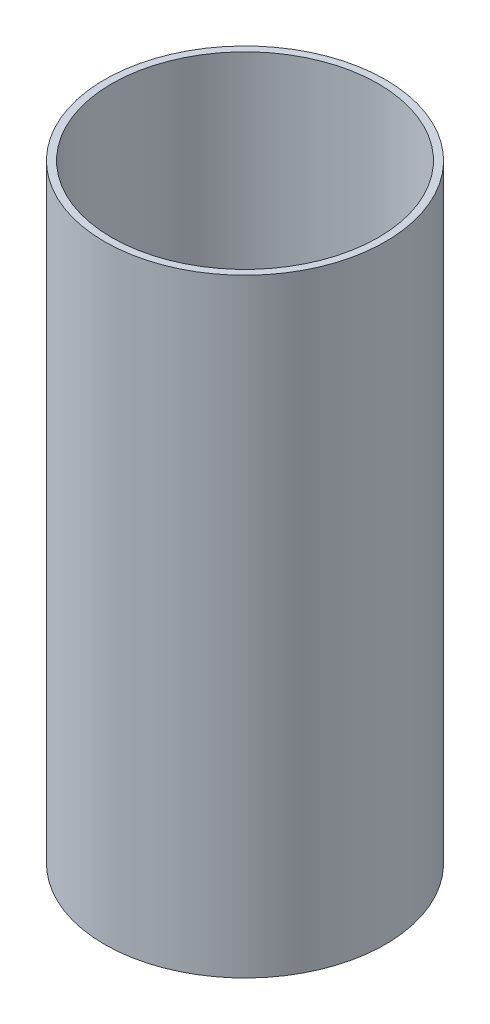
ISO-10303-21;
HEADER;
FILE_DESCRIPTION(('STEP AP214'),'2;1');
FILE_NAME('part.step','',(''),(''),'','','');
FILE_SCHEMA(('AUTOMOTIVE_DESIGN { 1 0 10303 214 1 1 1 1 }'));
ENDSEC;
DATA;
#1=APPLICATION_CONTEXT('core data for automotive mechanical design processes');
#2=APPLICATION_PROTOCOL_DEFINITION('international standard','automotive_design',2000,#1);
#3=PRODUCT_CONTEXT('',#1,'mechanical');
#4=PRODUCT('Part','Part','',(#3));
#5=PRODUCT_RELATED_PRODUCT_CATEGORY('part','',(#4));
#6=PRODUCT_DEFINITION_FORMATION('','',#4);
#7=PRODUCT_DEFINITION_CONTEXT('part definition',#1,'design');
#8=PRODUCT_DEFINITION('design','',#6,#7);
#9=PRODUCT_DEFINITION_SHAPE('','',#8);
#10=(LENGTH_UNIT() NAMED_UNIT(*) SI_UNIT(.MILLI.,.METRE.));
#11=(NAMED_UNIT(*) PLANE_ANGLE_UNIT() SI_UNIT($,.RADIAN.));
#12=(NAMED_UNIT(*) SI_UNIT($,.STERADIAN.) SOLID_ANGLE_UNIT());
#13=UNCERTAINTY_MEASURE_WITH_UNIT(LENGTH_MEASURE(1.E-05),#10,'distance_accuracy_value','');
#14=(GEOMETRIC_REPRESENTATION_CONTEXT(3) GLOBAL_UNCERTAINTY_ASSIGNED_CONTEXT((#13)) GLOBAL_UNIT_ASSIGNED_CONTEXT((#10,
#11,#12)) REPRESENTATION_CONTEXT('',''));
#15=CARTESIAN_POINT('',(0.,0.,0.));
#16=DIRECTION('',(0.,0.,1.));
#17=DIRECTION('',(1.,0.,0.));
#18=AXIS2_PLACEMENT_3D('',#15,#16,#17);
#19=CARTESIAN_POINT('',(0.,202.97775,0.));
#20=DIRECTION('',(0.,1.,0.));
#21=DIRECTION('',(0.,0.,1.));
#22=AXIS2_PLACEMENT_3D('',#19,#20,#21);
#23=PLANE('',#22);
#24=CARTESIAN_POINT('',(0.,202.97775,0.));
#25=DIRECTION('',(0.,1.,0.));
#26=DIRECTION('',(0.,0.,1.));
#27=AXIS2_PLACEMENT_3D('',#24,#25,#26);
#28=CIRCLE('',#27,93.6625);
#29=CARTESIAN_POINT('',(0.,202.97775,93.6625));
#30=VERTEX_POINT('',#29);
#31=EDGE_CURVE('E10',#30,#30,#28,.T.);
#32=ORIENTED_EDGE('',*,*,#31,.T.);
#33=EDGE_LOOP('',(#32));
#34=FACE_BOUND('',#33,.T.);
#35=CARTESIAN_POINT('',(0.,202.97775,0.));
#36=DIRECTION('',(0.,1.,0.));
#37=DIRECTION('',(0.,0.,1.));
#38=AXIS2_PLACEMENT_3D('',#35,#36,#37);
#39=CIRCLE('',#38,88.9);
#40=CARTESIAN_POINT('',(0.,202.97775,88.9));
#41=VERTEX_POINT('',#40);
#42=EDGE_CURVE('E46',#41,#41,#39,.T.);
#43=ORIENTED_EDGE('',*,*,#42,.F.);
#44=EDGE_LOOP('',(#43));
#45=FACE_BOUND('',#44,.T.);
#46=ADVANCED_FACE('F35',(#34,#45),#23,.T.);
#47=CARTESIAN_POINT('',(0.,-202.97775,0.));
#48=DIRECTION('',(0.,1.,0.));
#49=DIRECTION('',(0.,0.,1.));
#50=AXIS2_PLACEMENT_3D('',#47,#48,#49);
#51=PLANE('',#50);
#52=CARTESIAN_POINT('',(0.,-202.97775,0.));
#53=DIRECTION('',(0.,1.,0.));
#54=DIRECTION('',(0.,0.,1.));
#55=AXIS2_PLACEMENT_3D('',#52,#53,#54);
#56=CIRCLE('',#55,93.6625);
#57=CARTESIAN_POINT('',(0.,-202.97775,93.6625));
#58=VERTEX_POINT('',#57);
#59=EDGE_CURVE('E39',#58,#58,#56,.T.);
#60=ORIENTED_EDGE('',*,*,#59,.F.);
#61=EDGE_LOOP('',(#60));
#62=FACE_BOUND('',#61,.T.);
#63=CARTESIAN_POINT('',(0.,-202.97775,0.));
#64=DIRECTION('',(0.,1.,0.));
#65=DIRECTION('',(0.,0.,1.));
#66=AXIS2_PLACEMENT_3D('',#63,#64,#65);
#67=CIRCLE('',#66,88.9);
#68=CARTESIAN_POINT('',(0.,-202.97775,88.9));
#69=VERTEX_POINT('',#68);
#70=EDGE_CURVE('E48',#69,#69,#67,.T.);
#71=ORIENTED_EDGE('',*,*,#70,.T.);
#72=EDGE_LOOP('',(#71));
#73=FACE_BOUND('',#72,.T.);
#74=ADVANCED_FACE('F58',(#62,#73),#51,.F.);
#75=CARTESIAN_POINT('',(0.,202.97775,0.));
#76=DIRECTION('',(0.,-1.,0.));
#77=DIRECTION('',(0.,0.,-1.));
#78=AXIS2_PLACEMENT_3D('',#75,#76,#77);
#79=CYLINDRICAL_SURFACE('',#78,93.6625);
#80=ORIENTED_EDGE('',*,*,#31,.F.);
#81=EDGE_LOOP('',(#80));
#82=FACE_BOUND('',#81,.T.);
#83=ORIENTED_EDGE('',*,*,#59,.T.);
#84=EDGE_LOOP('',(#83));
#85=FACE_BOUND('',#84,.T.);
#86=ADVANCED_FACE('F37',(#82,#85),#79,.T.);
#87=CARTESIAN_POINT('',(0.,202.97775,0.));
#88=DIRECTION('',(0.,-1.,0.));
#89=DIRECTION('',(0.,0.,-1.));
#90=AXIS2_PLACEMENT_3D('',#87,#88,#89);
#91=CYLINDRICAL_SURFACE('',#90,88.9);
#92=ORIENTED_EDGE('',*,*,#42,.T.);
#93=EDGE_LOOP('',(#92));
#94=FACE_BOUND('',#93,.T.);
#95=ORIENTED_EDGE('',*,*,#70,.F.);
#96=EDGE_LOOP('',(#95));
#97=FACE_BOUND('',#96,.T.);
#98=ADVANCED_FACE('F54',(#94,#97),#91,.F.);
#99=CLOSED_SHELL('',(#46,#74,#86,#98));
#100=MANIFOLD_SOLID_BREP('B2',#99);
#101=ADVANCED_BREP_SHAPE_REPRESENTATION('',(#18,#100),#14);
#102=SHAPE_DEFINITION_REPRESENTATION(#9,#101);
ENDSEC;
END-ISO-10303-21;
